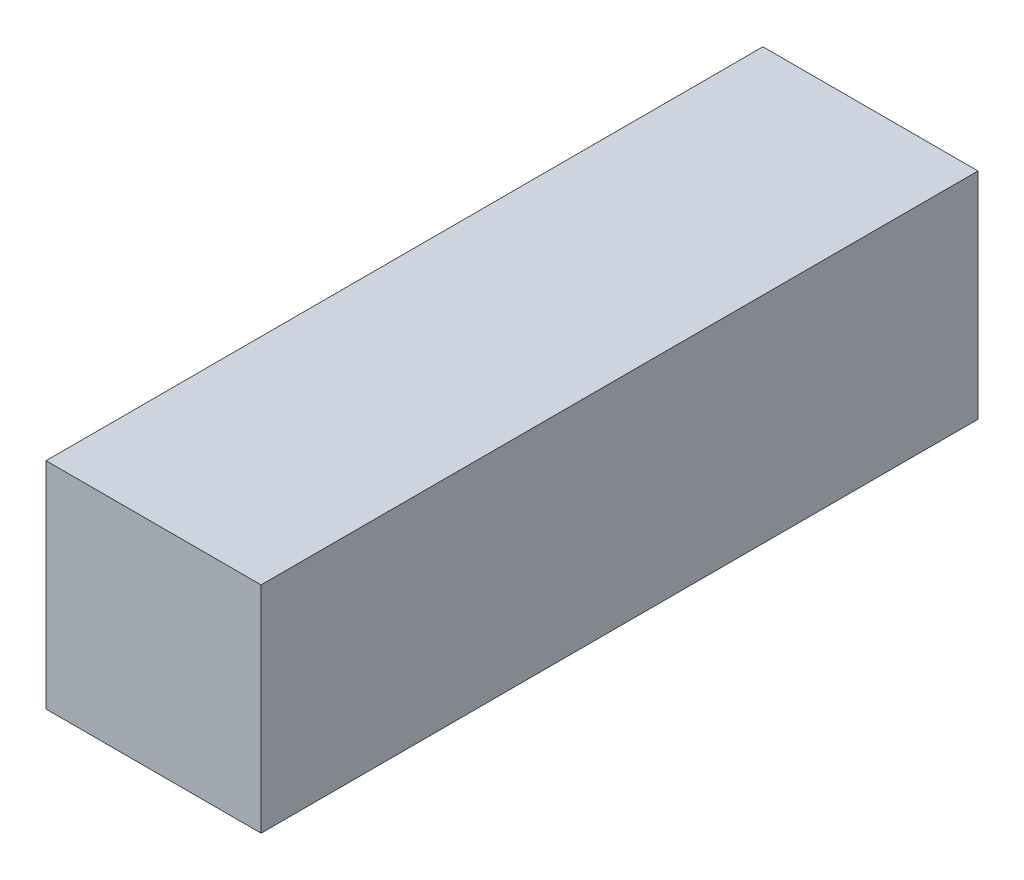
ISO-10303-21;
HEADER;
FILE_DESCRIPTION(('STEP AP214'),'2;1');
FILE_NAME('part.step','',(''),(''),'','','');
FILE_SCHEMA(('AUTOMOTIVE_DESIGN { 1 0 10303 214 1 1 1 1 }'));
ENDSEC;
DATA;
#1=APPLICATION_CONTEXT('core data for automotive mechanical design processes');
#2=APPLICATION_PROTOCOL_DEFINITION('international standard','automotive_design',2000,#1);
#3=PRODUCT_CONTEXT('',#1,'mechanical');
#4=PRODUCT('Part','Part','',(#3));
#5=PRODUCT_RELATED_PRODUCT_CATEGORY('part','',(#4));
#6=PRODUCT_DEFINITION_FORMATION('','',#4);
#7=PRODUCT_DEFINITION_CONTEXT('part definition',#1,'design');
#8=PRODUCT_DEFINITION('design','',#6,#7);
#9=PRODUCT_DEFINITION_SHAPE('','',#8);
#10=(LENGTH_UNIT() NAMED_UNIT(*) SI_UNIT(.MILLI.,.METRE.));
#11=(NAMED_UNIT(*) PLANE_ANGLE_UNIT() SI_UNIT($,.RADIAN.));
#12=(NAMED_UNIT(*) SI_UNIT($,.STERADIAN.) SOLID_ANGLE_UNIT());
#13=UNCERTAINTY_MEASURE_WITH_UNIT(LENGTH_MEASURE(1.E-05),#10,'distance_accuracy_value','');
#14=(GEOMETRIC_REPRESENTATION_CONTEXT(3) GLOBAL_UNCERTAINTY_ASSIGNED_CONTEXT((#13)) GLOBAL_UNIT_ASSIGNED_CONTEXT((#10,
#11,#12)) REPRESENTATION_CONTEXT('',''));
#15=CARTESIAN_POINT('',(0.,0.,0.));
#16=DIRECTION('',(0.,0.,1.));
#17=DIRECTION('',(1.,0.,0.));
#18=AXIS2_PLACEMENT_3D('',#15,#16,#17);
#19=CARTESIAN_POINT('',(0.,0.,-60.));
#20=DIRECTION('',(-1.,0.,0.));
#21=DIRECTION('',(0.,0.,1.));
#22=AXIS2_PLACEMENT_3D('',#19,#20,#21);
#23=PLANE('',#22);
#24=DIRECTION('',(0.,-1.,0.));
#25=VECTOR('',#24,1.);
#26=CARTESIAN_POINT('',(0.,0.,0.));
#27=LINE('',#26,#25);
#28=CARTESIAN_POINT('',(0.,18.,0.));
#29=VERTEX_POINT('',#28);
#30=CARTESIAN_POINT('',(0.,0.,0.));
#31=VERTEX_POINT('',#30);
#32=EDGE_CURVE('E95',#29,#31,#27,.T.);
#33=ORIENTED_EDGE('',*,*,#32,.F.);
#34=DIRECTION('',(0.,0.,1.));
#35=VECTOR('',#34,1.);
#36=CARTESIAN_POINT('',(0.,18.,-60.));
#37=LINE('',#36,#35);
#38=CARTESIAN_POINT('',(0.,18.,-60.));
#39=VERTEX_POINT('',#38);
#40=EDGE_CURVE('E11',#39,#29,#37,.T.);
#41=ORIENTED_EDGE('',*,*,#40,.F.);
#42=DIRECTION('',(0.,-1.,0.));
#43=VECTOR('',#42,1.);
#44=CARTESIAN_POINT('',(0.,0.,-60.));
#45=LINE('',#44,#43);
#46=CARTESIAN_POINT('',(0.,0.,-60.));
#47=VERTEX_POINT('',#46);
#48=EDGE_CURVE('E89',#39,#47,#45,.T.);
#49=ORIENTED_EDGE('',*,*,#48,.T.);
#50=DIRECTION('',(0.,0.,1.));
#51=VECTOR('',#50,1.);
#52=CARTESIAN_POINT('',(0.,0.,-60.));
#53=LINE('',#52,#51);
#54=EDGE_CURVE('E34',#47,#31,#53,.T.);
#55=ORIENTED_EDGE('',*,*,#54,.T.);
#56=EDGE_LOOP('',(#33,#41,#49,#55));
#57=FACE_BOUND('',#56,.T.);
#58=ADVANCED_FACE('F31',(#57),#23,.T.);
#59=CARTESIAN_POINT('',(0.,18.,-60.));
#60=DIRECTION('',(0.,1.,0.));
#61=DIRECTION('',(0.,0.,1.));
#62=AXIS2_PLACEMENT_3D('',#59,#60,#61);
#63=PLANE('',#62);
#64=DIRECTION('',(-1.,0.,0.));
#65=VECTOR('',#64,1.);
#66=CARTESIAN_POINT('',(0.,18.,0.));
#67=LINE('',#66,#65);
#68=CARTESIAN_POINT('',(18.,18.,0.));
#69=VERTEX_POINT('',#68);
#70=EDGE_CURVE('E91',#69,#29,#67,.T.);
#71=ORIENTED_EDGE('',*,*,#70,.F.);
#72=DIRECTION('',(0.,0.,1.));
#73=VECTOR('',#72,1.);
#74=CARTESIAN_POINT('',(18.,18.,-60.));
#75=LINE('',#74,#73);
#76=CARTESIAN_POINT('',(18.,18.,-60.));
#77=VERTEX_POINT('',#76);
#78=EDGE_CURVE('E40',#77,#69,#75,.T.);
#79=ORIENTED_EDGE('',*,*,#78,.F.);
#80=DIRECTION('',(-1.,0.,0.));
#81=VECTOR('',#80,1.);
#82=CARTESIAN_POINT('',(0.,18.,-60.));
#83=LINE('',#82,#81);
#84=EDGE_CURVE('E86',#77,#39,#83,.T.);
#85=ORIENTED_EDGE('',*,*,#84,.T.);
#86=ORIENTED_EDGE('',*,*,#40,.T.);
#87=EDGE_LOOP('',(#71,#79,#85,#86));
#88=FACE_BOUND('',#87,.T.);
#89=ADVANCED_FACE('F105',(#88),#63,.T.);
#90=CARTESIAN_POINT('',(18.,0.,-60.));
#91=DIRECTION('',(1.,0.,0.));
#92=DIRECTION('',(0.,0.,-1.));
#93=AXIS2_PLACEMENT_3D('',#90,#91,#92);
#94=PLANE('',#93);
#95=DIRECTION('',(0.,1.,0.));
#96=VECTOR('',#95,1.);
#97=CARTESIAN_POINT('',(18.,0.,0.));
#98=LINE('',#97,#96);
#99=CARTESIAN_POINT('',(18.,0.,0.));
#100=VERTEX_POINT('',#99);
#101=EDGE_CURVE('E81',#100,#69,#98,.T.);
#102=ORIENTED_EDGE('',*,*,#101,.F.);
#103=DIRECTION('',(0.,0.,1.));
#104=VECTOR('',#103,1.);
#105=CARTESIAN_POINT('',(18.,0.,-60.));
#106=LINE('',#105,#104);
#107=CARTESIAN_POINT('',(18.,0.,-60.));
#108=VERTEX_POINT('',#107);
#109=EDGE_CURVE('E76',#108,#100,#106,.T.);
#110=ORIENTED_EDGE('',*,*,#109,.F.);
#111=DIRECTION('',(0.,1.,0.));
#112=VECTOR('',#111,1.);
#113=CARTESIAN_POINT('',(18.,0.,-60.));
#114=LINE('',#113,#112);
#115=EDGE_CURVE('E79',#108,#77,#114,.T.);
#116=ORIENTED_EDGE('',*,*,#115,.T.);
#117=ORIENTED_EDGE('',*,*,#78,.T.);
#118=EDGE_LOOP('',(#102,#110,#116,#117));
#119=FACE_BOUND('',#118,.T.);
#120=ADVANCED_FACE('F78',(#119),#94,.T.);
#121=CARTESIAN_POINT('',(0.,0.,-60.));
#122=DIRECTION('',(0.,-1.,0.));
#123=DIRECTION('',(0.,0.,-1.));
#124=AXIS2_PLACEMENT_3D('',#121,#122,#123);
#125=PLANE('',#124);
#126=DIRECTION('',(1.,0.,0.));
#127=VECTOR('',#126,1.);
#128=CARTESIAN_POINT('',(0.,0.,0.));
#129=LINE('',#128,#127);
#130=EDGE_CURVE('E98',#31,#100,#129,.T.);
#131=ORIENTED_EDGE('',*,*,#130,.F.);
#132=ORIENTED_EDGE('',*,*,#54,.F.);
#133=DIRECTION('',(1.,0.,0.));
#134=VECTOR('',#133,1.);
#135=CARTESIAN_POINT('',(0.,0.,-60.));
#136=LINE('',#135,#134);
#137=EDGE_CURVE('E85',#47,#108,#136,.T.);
#138=ORIENTED_EDGE('',*,*,#137,.T.);
#139=ORIENTED_EDGE('',*,*,#109,.T.);
#140=EDGE_LOOP('',(#131,#132,#138,#139));
#141=FACE_BOUND('',#140,.T.);
#142=ADVANCED_FACE('F88',(#141),#125,.T.);
#143=CARTESIAN_POINT('',(0.,18.,-60.));
#144=DIRECTION('',(0.,0.,-1.));
#145=DIRECTION('',(-1.,0.,0.));
#146=AXIS2_PLACEMENT_3D('',#143,#144,#145);
#147=PLANE('',#146);
#148=ORIENTED_EDGE('',*,*,#48,.F.);
#149=ORIENTED_EDGE('',*,*,#84,.F.);
#150=ORIENTED_EDGE('',*,*,#115,.F.);
#151=ORIENTED_EDGE('',*,*,#137,.F.);
#152=EDGE_LOOP('',(#148,#149,#150,#151));
#153=FACE_BOUND('',#152,.T.);
#154=ADVANCED_FACE('F84',(#153),#147,.T.);
#155=CARTESIAN_POINT('',(0.,18.,0.));
#156=DIRECTION('',(0.,0.,-1.));
#157=DIRECTION('',(-1.,0.,0.));
#158=AXIS2_PLACEMENT_3D('',#155,#156,#157);
#159=PLANE('',#158);
#160=ORIENTED_EDGE('',*,*,#32,.T.);
#161=ORIENTED_EDGE('',*,*,#130,.T.);
#162=ORIENTED_EDGE('',*,*,#101,.T.);
#163=ORIENTED_EDGE('',*,*,#70,.T.);
#164=EDGE_LOOP('',(#160,#161,#162,#163));
#165=FACE_BOUND('',#164,.T.);
#166=ADVANCED_FACE('F104',(#165),#159,.F.);
#167=CLOSED_SHELL('',(#58,#89,#120,#142,#154,#166));
#168=MANIFOLD_SOLID_BREP('B2',#167);
#169=ADVANCED_BREP_SHAPE_REPRESENTATION('',(#18,#168),#14);
#170=SHAPE_DEFINITION_REPRESENTATION(#9,#169);
ENDSEC;
END-ISO-10303-21;
